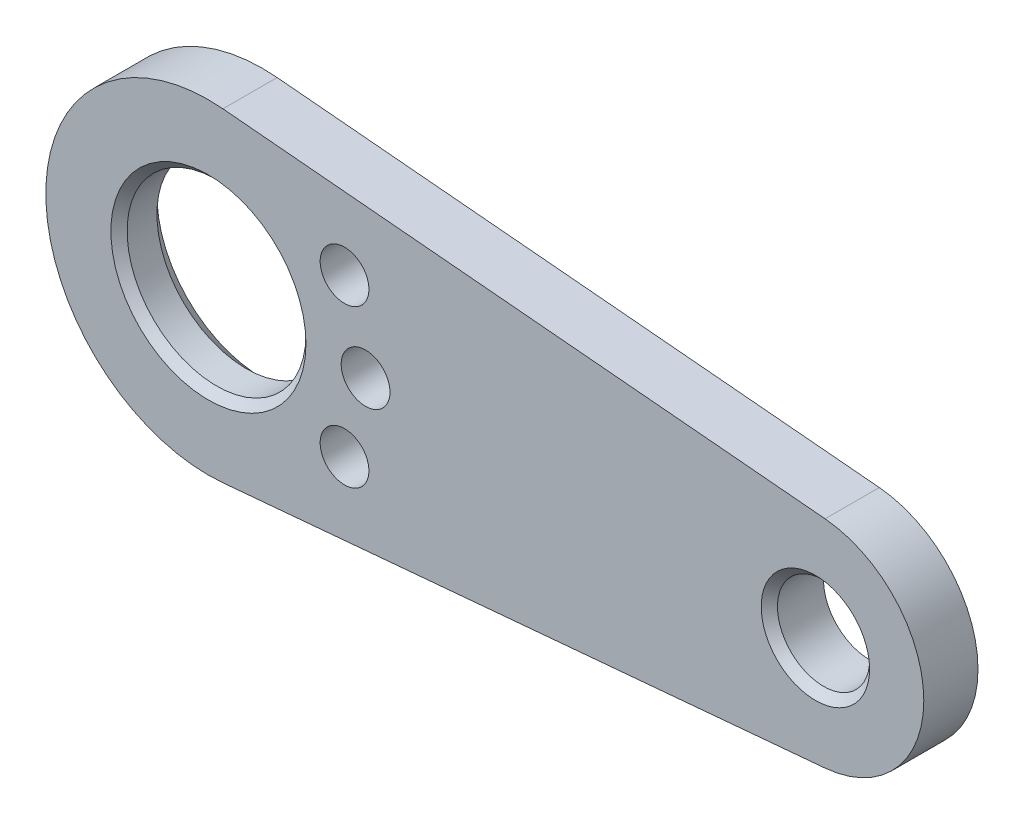
ISO-10303-21;
HEADER;
FILE_DESCRIPTION(('STEP AP214'),'2;1');
FILE_NAME('part.step','',(''),(''),'','','');
FILE_SCHEMA(('AUTOMOTIVE_DESIGN { 1 0 10303 214 1 1 1 1 }'));
ENDSEC;
DATA;
#1=APPLICATION_CONTEXT('core data for automotive mechanical design processes');
#2=APPLICATION_PROTOCOL_DEFINITION('international standard','automotive_design',2000,#1);
#3=PRODUCT_CONTEXT('',#1,'mechanical');
#4=PRODUCT('Part','Part','',(#3));
#5=PRODUCT_RELATED_PRODUCT_CATEGORY('part','',(#4));
#6=PRODUCT_DEFINITION_FORMATION('','',#4);
#7=PRODUCT_DEFINITION_CONTEXT('part definition',#1,'design');
#8=PRODUCT_DEFINITION('design','',#6,#7);
#9=PRODUCT_DEFINITION_SHAPE('','',#8);
#10=(LENGTH_UNIT() NAMED_UNIT(*) SI_UNIT(.MILLI.,.METRE.));
#11=(NAMED_UNIT(*) PLANE_ANGLE_UNIT() SI_UNIT($,.RADIAN.));
#12=(NAMED_UNIT(*) SI_UNIT($,.STERADIAN.) SOLID_ANGLE_UNIT());
#13=UNCERTAINTY_MEASURE_WITH_UNIT(LENGTH_MEASURE(1.E-05),#10,'distance_accuracy_value','');
#14=(GEOMETRIC_REPRESENTATION_CONTEXT(3) GLOBAL_UNCERTAINTY_ASSIGNED_CONTEXT((#13)) GLOBAL_UNIT_ASSIGNED_CONTEXT((#10,
#11,#12)) REPRESENTATION_CONTEXT('',''));
#15=CARTESIAN_POINT('',(0.,0.,0.));
#16=DIRECTION('',(0.,0.,1.));
#17=DIRECTION('',(1.,0.,0.));
#18=AXIS2_PLACEMENT_3D('',#15,#16,#17);
#19=CARTESIAN_POINT('',(0.,0.,-1.));
#20=DIRECTION('',(0.,0.,1.));
#21=DIRECTION('',(1.,0.,0.));
#22=AXIS2_PLACEMENT_3D('',#19,#20,#21);
#23=CYLINDRICAL_SURFACE('',#22,3.);
#24=CARTESIAN_POINT('',(0.,0.,0.));
#25=DIRECTION('',(0.,0.,1.));
#26=DIRECTION('',(1.,0.,0.));
#27=AXIS2_PLACEMENT_3D('',#24,#25,#26);
#28=CIRCLE('',#27,3.);
#29=CARTESIAN_POINT('',(0.267857142857143,2.9880181644395,0.));
#30=VERTEX_POINT('',#29);
#31=CARTESIAN_POINT('',(0.267857142857143,-2.9880181644395,0.));
#32=VERTEX_POINT('',#31);
#33=EDGE_CURVE('E138',#30,#32,#28,.T.);
#34=ORIENTED_EDGE('',*,*,#33,.F.);
#35=DIRECTION('',(0.,0.,1.));
#36=VECTOR('',#35,1.);
#37=CARTESIAN_POINT('',(0.267857142857143,2.9880181644395,-1.));
#38=LINE('',#37,#36);
#39=CARTESIAN_POINT('',(0.267857142857143,2.9880181644395,-1.));
#40=VERTEX_POINT('',#39);
#41=EDGE_CURVE('E86',#40,#30,#38,.T.);
#42=ORIENTED_EDGE('',*,*,#41,.F.);
#43=CARTESIAN_POINT('',(0.,0.,-1.));
#44=DIRECTION('',(0.,0.,1.));
#45=DIRECTION('',(1.,0.,0.));
#46=AXIS2_PLACEMENT_3D('',#43,#44,#45);
#47=CIRCLE('',#46,3.);
#48=CARTESIAN_POINT('',(0.267857142857143,-2.9880181644395,-1.));
#49=VERTEX_POINT('',#48);
#50=EDGE_CURVE('E131',#40,#49,#47,.T.);
#51=ORIENTED_EDGE('',*,*,#50,.T.);
#52=DIRECTION('',(0.,0.,1.));
#53=VECTOR('',#52,1.);
#54=CARTESIAN_POINT('',(0.267857142857143,-2.9880181644395,-1.));
#55=LINE('',#54,#53);
#56=EDGE_CURVE('E114',#49,#32,#55,.T.);
#57=ORIENTED_EDGE('',*,*,#56,.T.);
#58=EDGE_LOOP('',(#34,#42,#51,#57));
#59=FACE_BOUND('',#58,.T.);
#60=ADVANCED_FACE('F69',(#59),#23,.T.);
#61=CARTESIAN_POINT('',(0.267857142857143,2.9880181644395,-1.));
#62=DIRECTION('',(0.0892857142857142,0.996006054813167,0.));
#63=DIRECTION('',(-0.996006054813167,0.0892857142857142,0.));
#64=AXIS2_PLACEMENT_3D('',#61,#62,#63);
#65=PLANE('',#64);
#66=DIRECTION('',(-0.996006054813167,0.0892857142857142,0.));
#67=VECTOR('',#66,1.);
#68=CARTESIAN_POINT('',(0.267857142857143,2.9880181644395,0.));
#69=LINE('',#68,#67);
#70=CARTESIAN_POINT('',(11.3785714285714,1.99201210962634,0.));
#71=VERTEX_POINT('',#70);
#72=EDGE_CURVE('E133',#71,#30,#69,.T.);
#73=ORIENTED_EDGE('',*,*,#72,.F.);
#74=DIRECTION('',(0.,0.,1.));
#75=VECTOR('',#74,1.);
#76=CARTESIAN_POINT('',(11.3785714285714,1.99201210962634,-1.));
#77=LINE('',#76,#75);
#78=CARTESIAN_POINT('',(11.3785714285714,1.99201210962634,-1.));
#79=VERTEX_POINT('',#78);
#80=EDGE_CURVE('E103',#79,#71,#77,.T.);
#81=ORIENTED_EDGE('',*,*,#80,.F.);
#82=DIRECTION('',(-0.996006054813167,0.0892857142857142,0.));
#83=VECTOR('',#82,1.);
#84=CARTESIAN_POINT('',(0.267857142857143,2.9880181644395,-1.));
#85=LINE('',#84,#83);
#86=EDGE_CURVE('E128',#79,#40,#85,.T.);
#87=ORIENTED_EDGE('',*,*,#86,.T.);
#88=ORIENTED_EDGE('',*,*,#41,.T.);
#89=EDGE_LOOP('',(#73,#81,#87,#88));
#90=FACE_BOUND('',#89,.T.);
#91=ADVANCED_FACE('F181',(#90),#65,.T.);
#92=CARTESIAN_POINT('',(11.2,0.,-1.));
#93=DIRECTION('',(0.,0.,1.));
#94=DIRECTION('',(1.,0.,0.));
#95=AXIS2_PLACEMENT_3D('',#92,#93,#94);
#96=CYLINDRICAL_SURFACE('',#95,2.);
#97=CARTESIAN_POINT('',(11.2,0.,0.));
#98=DIRECTION('',(0.,0.,1.));
#99=DIRECTION('',(1.,0.,0.));
#100=AXIS2_PLACEMENT_3D('',#97,#98,#99);
#101=CIRCLE('',#100,2.);
#102=CARTESIAN_POINT('',(11.3785714285714,-1.99201210962634,0.));
#103=VERTEX_POINT('',#102);
#104=EDGE_CURVE('E122',#103,#71,#101,.T.);
#105=ORIENTED_EDGE('',*,*,#104,.F.);
#106=DIRECTION('',(0.,0.,1.));
#107=VECTOR('',#106,1.);
#108=CARTESIAN_POINT('',(11.3785714285714,-1.99201210962634,-1.));
#109=LINE('',#108,#107);
#110=CARTESIAN_POINT('',(11.3785714285714,-1.99201210962634,-1.));
#111=VERTEX_POINT('',#110);
#112=EDGE_CURVE('E117',#111,#103,#109,.T.);
#113=ORIENTED_EDGE('',*,*,#112,.F.);
#114=CARTESIAN_POINT('',(11.2,0.,-1.));
#115=DIRECTION('',(0.,0.,1.));
#116=DIRECTION('',(1.,0.,0.));
#117=AXIS2_PLACEMENT_3D('',#114,#115,#116);
#118=CIRCLE('',#117,2.);
#119=EDGE_CURVE('E120',#111,#79,#118,.T.);
#120=ORIENTED_EDGE('',*,*,#119,.T.);
#121=ORIENTED_EDGE('',*,*,#80,.T.);
#122=EDGE_LOOP('',(#105,#113,#120,#121));
#123=FACE_BOUND('',#122,.T.);
#124=ADVANCED_FACE('F119',(#123),#96,.T.);
#125=CARTESIAN_POINT('',(0.267857142857143,-2.9880181644395,-1.));
#126=DIRECTION('',(0.0892857142857142,-0.996006054813167,0.));
#127=DIRECTION('',(0.996006054813167,0.0892857142857142,0.));
#128=AXIS2_PLACEMENT_3D('',#125,#126,#127);
#129=PLANE('',#128);
#130=DIRECTION('',(0.996006054813167,0.0892857142857142,0.));
#131=VECTOR('',#130,1.);
#132=CARTESIAN_POINT('',(0.267857142857143,-2.9880181644395,0.));
#133=LINE('',#132,#131);
#134=EDGE_CURVE('E141',#32,#103,#133,.T.);
#135=ORIENTED_EDGE('',*,*,#134,.F.);
#136=ORIENTED_EDGE('',*,*,#56,.F.);
#137=DIRECTION('',(0.996006054813167,0.0892857142857142,0.));
#138=VECTOR('',#137,1.);
#139=CARTESIAN_POINT('',(0.267857142857143,-2.9880181644395,-1.));
#140=LINE('',#139,#138);
#141=EDGE_CURVE('E127',#49,#111,#140,.T.);
#142=ORIENTED_EDGE('',*,*,#141,.T.);
#143=ORIENTED_EDGE('',*,*,#112,.T.);
#144=EDGE_LOOP('',(#135,#136,#142,#143));
#145=FACE_BOUND('',#144,.T.);
#146=ADVANCED_FACE('F130',(#145),#129,.T.);
#147=CARTESIAN_POINT('',(0.,0.,-1.));
#148=DIRECTION('',(0.,0.,1.));
#149=DIRECTION('',(1.,0.,0.));
#150=AXIS2_PLACEMENT_3D('',#147,#148,#149);
#151=PLANE('',#150);
#152=CARTESIAN_POINT('',(2.9,0.,-1.));
#153=DIRECTION('',(0.,0.,1.));
#154=DIRECTION('',(1.,0.,0.));
#155=AXIS2_PLACEMENT_3D('',#152,#153,#154);
#156=CIRCLE('',#155,0.45);
#157=CARTESIAN_POINT('',(3.35,0.,-1.));
#158=VERTEX_POINT('',#157);
#159=EDGE_CURVE('E218',#158,#158,#156,.T.);
#160=ORIENTED_EDGE('',*,*,#159,.T.);
#161=EDGE_LOOP('',(#160));
#162=FACE_BOUND('',#161,.T.);
#163=CARTESIAN_POINT('',(2.51147367097487,1.45,-1.));
#164=DIRECTION('',(0.,0.,1.));
#165=DIRECTION('',(1.,0.,0.));
#166=AXIS2_PLACEMENT_3D('',#163,#164,#165);
#167=CIRCLE('',#166,0.45);
#168=CARTESIAN_POINT('',(2.96147367097487,1.45,-1.));
#169=VERTEX_POINT('',#168);
#170=EDGE_CURVE('E212',#169,#169,#167,.T.);
#171=ORIENTED_EDGE('',*,*,#170,.T.);
#172=EDGE_LOOP('',(#171));
#173=FACE_BOUND('',#172,.T.);
#174=CARTESIAN_POINT('',(2.51147367097487,-1.45,-1.));
#175=DIRECTION('',(0.,0.,1.));
#176=DIRECTION('',(1.,0.,0.));
#177=AXIS2_PLACEMENT_3D('',#174,#175,#176);
#178=CIRCLE('',#177,0.45);
#179=CARTESIAN_POINT('',(2.96147367097487,-1.45,-1.));
#180=VERTEX_POINT('',#179);
#181=EDGE_CURVE('E205',#180,#180,#178,.T.);
#182=ORIENTED_EDGE('',*,*,#181,.T.);
#183=EDGE_LOOP('',(#182));
#184=FACE_BOUND('',#183,.T.);
#185=CARTESIAN_POINT('',(0.,0.,-1.));
#186=DIRECTION('',(0.,0.,1.));
#187=DIRECTION('',(1.,0.,0.));
#188=AXIS2_PLACEMENT_3D('',#185,#186,#187);
#189=CIRCLE('',#188,1.95);
#190=CARTESIAN_POINT('',(1.95,0.,-1.));
#191=VERTEX_POINT('',#190);
#192=EDGE_CURVE('E78',#191,#191,#189,.T.);
#193=ORIENTED_EDGE('',*,*,#192,.T.);
#194=EDGE_LOOP('',(#193));
#195=FACE_BOUND('',#194,.T.);
#196=CARTESIAN_POINT('',(11.2,0.,-1.));
#197=DIRECTION('',(0.,0.,1.));
#198=DIRECTION('',(1.,0.,0.));
#199=AXIS2_PLACEMENT_3D('',#196,#197,#198);
#200=CIRCLE('',#199,0.85);
#201=CARTESIAN_POINT('',(12.05,0.,-1.));
#202=VERTEX_POINT('',#201);
#203=EDGE_CURVE('E142',#202,#202,#200,.T.);
#204=ORIENTED_EDGE('',*,*,#203,.T.);
#205=EDGE_LOOP('',(#204));
#206=FACE_BOUND('',#205,.T.);
#207=ORIENTED_EDGE('',*,*,#50,.F.);
#208=ORIENTED_EDGE('',*,*,#86,.F.);
#209=ORIENTED_EDGE('',*,*,#119,.F.);
#210=ORIENTED_EDGE('',*,*,#141,.F.);
#211=EDGE_LOOP('',(#207,#208,#209,#210));
#212=FACE_BOUND('',#211,.T.);
#213=ADVANCED_FACE('F126',(#162,#173,#184,#195,#206,#212),#151,.F.);
#214=CARTESIAN_POINT('',(0.,0.,0.));
#215=DIRECTION('',(0.,0.,1.));
#216=DIRECTION('',(1.,0.,0.));
#217=AXIS2_PLACEMENT_3D('',#214,#215,#216);
#218=PLANE('',#217);
#219=CARTESIAN_POINT('',(2.9,0.,0.));
#220=DIRECTION('',(0.,0.,1.));
#221=DIRECTION('',(1.,0.,0.));
#222=AXIS2_PLACEMENT_3D('',#219,#220,#221);
#223=CIRCLE('',#222,0.45);
#224=CARTESIAN_POINT('',(3.35,0.,0.));
#225=VERTEX_POINT('',#224);
#226=EDGE_CURVE('E221',#225,#225,#223,.T.);
#227=ORIENTED_EDGE('',*,*,#226,.F.);
#228=EDGE_LOOP('',(#227));
#229=FACE_BOUND('',#228,.T.);
#230=CARTESIAN_POINT('',(2.51147367097487,1.45,0.));
#231=DIRECTION('',(0.,0.,1.));
#232=DIRECTION('',(1.,0.,0.));
#233=AXIS2_PLACEMENT_3D('',#230,#231,#232);
#234=CIRCLE('',#233,0.45);
#235=CARTESIAN_POINT('',(2.96147367097487,1.45,0.));
#236=VERTEX_POINT('',#235);
#237=EDGE_CURVE('E215',#236,#236,#234,.T.);
#238=ORIENTED_EDGE('',*,*,#237,.F.);
#239=EDGE_LOOP('',(#238));
#240=FACE_BOUND('',#239,.T.);
#241=CARTESIAN_POINT('',(2.51147367097487,-1.45,0.));
#242=DIRECTION('',(0.,0.,1.));
#243=DIRECTION('',(1.,0.,0.));
#244=AXIS2_PLACEMENT_3D('',#241,#242,#243);
#245=CIRCLE('',#244,0.45);
#246=CARTESIAN_POINT('',(2.96147367097487,-1.45,0.));
#247=VERTEX_POINT('',#246);
#248=EDGE_CURVE('E207',#247,#247,#245,.T.);
#249=ORIENTED_EDGE('',*,*,#248,.F.);
#250=EDGE_LOOP('',(#249));
#251=FACE_BOUND('',#250,.T.);
#252=CARTESIAN_POINT('',(11.2,0.,0.));
#253=DIRECTION('',(0.,0.,1.));
#254=DIRECTION('',(1.,0.,0.));
#255=AXIS2_PLACEMENT_3D('',#252,#253,#254);
#256=CIRCLE('',#255,1.);
#257=CARTESIAN_POINT('',(12.2,0.,0.));
#258=VERTEX_POINT('',#257);
#259=EDGE_CURVE('E156',#258,#258,#256,.F.);
#260=ORIENTED_EDGE('',*,*,#259,.T.);
#261=EDGE_LOOP('',(#260));
#262=FACE_BOUND('',#261,.T.);
#263=CARTESIAN_POINT('',(0.,0.,0.));
#264=DIRECTION('',(0.,0.,1.));
#265=DIRECTION('',(1.,0.,0.));
#266=AXIS2_PLACEMENT_3D('',#263,#264,#265);
#267=CIRCLE('',#266,1.8);
#268=CARTESIAN_POINT('',(1.8,0.,0.));
#269=VERTEX_POINT('',#268);
#270=EDGE_CURVE('E153',#269,#269,#267,.F.);
#271=ORIENTED_EDGE('',*,*,#270,.T.);
#272=EDGE_LOOP('',(#271));
#273=FACE_BOUND('',#272,.T.);
#274=ORIENTED_EDGE('',*,*,#33,.T.);
#275=ORIENTED_EDGE('',*,*,#134,.T.);
#276=ORIENTED_EDGE('',*,*,#104,.T.);
#277=ORIENTED_EDGE('',*,*,#72,.T.);
#278=EDGE_LOOP('',(#274,#275,#276,#277));
#279=FACE_BOUND('',#278,.T.);
#280=ADVANCED_FACE('F227',(#229,#240,#251,#262,#273,#279),#218,.T.);
#281=CARTESIAN_POINT('',(0.,0.,-1.));
#282=DIRECTION('',(0.,0.,1.));
#283=DIRECTION('',(1.,0.,0.));
#284=AXIS2_PLACEMENT_3D('',#281,#282,#283);
#285=CYLINDRICAL_SURFACE('',#284,1.65);
#286=CARTESIAN_POINT('',(0.,0.,-0.700000000000003));
#287=DIRECTION('',(0.,0.,1.));
#288=DIRECTION('',(1.,0.,0.));
#289=AXIS2_PLACEMENT_3D('',#286,#287,#288);
#290=CIRCLE('',#289,1.65);
#291=CARTESIAN_POINT('',(1.65,0.,-0.700000000000003));
#292=VERTEX_POINT('',#291);
#293=EDGE_CURVE('E14',#292,#292,#290,.F.);
#294=ORIENTED_EDGE('',*,*,#293,.T.);
#295=EDGE_LOOP('',(#294));
#296=FACE_BOUND('',#295,.T.);
#297=CARTESIAN_POINT('',(0.,0.,-0.150000000000001));
#298=DIRECTION('',(0.,0.,1.));
#299=DIRECTION('',(1.,0.,0.));
#300=AXIS2_PLACEMENT_3D('',#297,#298,#299);
#301=CIRCLE('',#300,1.65);
#302=CARTESIAN_POINT('',(1.65,0.,-0.150000000000001));
#303=VERTEX_POINT('',#302);
#304=EDGE_CURVE('E159',#303,#303,#301,.T.);
#305=ORIENTED_EDGE('',*,*,#304,.T.);
#306=EDGE_LOOP('',(#305));
#307=FACE_BOUND('',#306,.T.);
#308=ADVANCED_FACE('F196',(#296,#307),#285,.F.);
#309=CARTESIAN_POINT('',(11.2,0.,-1.));
#310=DIRECTION('',(0.,0.,1.));
#311=DIRECTION('',(1.,0.,0.));
#312=AXIS2_PLACEMENT_3D('',#309,#310,#311);
#313=CYLINDRICAL_SURFACE('',#312,0.85);
#314=CARTESIAN_POINT('',(11.2,0.,-0.150000000000001));
#315=DIRECTION('',(0.,0.,1.));
#316=DIRECTION('',(1.,0.,0.));
#317=AXIS2_PLACEMENT_3D('',#314,#315,#316);
#318=CIRCLE('',#317,0.85);
#319=CARTESIAN_POINT('',(12.05,0.,-0.150000000000001));
#320=VERTEX_POINT('',#319);
#321=EDGE_CURVE('E148',#320,#320,#318,.T.);
#322=ORIENTED_EDGE('',*,*,#321,.T.);
#323=EDGE_LOOP('',(#322));
#324=FACE_BOUND('',#323,.T.);
#325=ORIENTED_EDGE('',*,*,#203,.F.);
#326=EDGE_LOOP('',(#325));
#327=FACE_BOUND('',#326,.T.);
#328=ADVANCED_FACE('F191',(#324,#327),#313,.F.);
#329=CARTESIAN_POINT('',(11.2,0.,-0.150000000000001));
#330=DIRECTION('',(0.,0.,1.));
#331=DIRECTION('',(1.,0.,0.));
#332=AXIS2_PLACEMENT_3D('',#329,#330,#331);
#333=CONICAL_SURFACE('',#332,0.85,0.78539816339745);
#334=ORIENTED_EDGE('',*,*,#259,.F.);
#335=EDGE_LOOP('',(#334));
#336=FACE_BOUND('',#335,.T.);
#337=ORIENTED_EDGE('',*,*,#321,.F.);
#338=EDGE_LOOP('',(#337));
#339=FACE_BOUND('',#338,.T.);
#340=ADVANCED_FACE('F177',(#336,#339),#333,.F.);
#341=CARTESIAN_POINT('',(0.,0.,-0.150000000000001));
#342=DIRECTION('',(0.,0.,1.));
#343=DIRECTION('',(1.,0.,0.));
#344=AXIS2_PLACEMENT_3D('',#341,#342,#343);
#345=CONICAL_SURFACE('',#344,1.65,0.785398163397453);
#346=ORIENTED_EDGE('',*,*,#270,.F.);
#347=EDGE_LOOP('',(#346));
#348=FACE_BOUND('',#347,.T.);
#349=ORIENTED_EDGE('',*,*,#304,.F.);
#350=EDGE_LOOP('',(#349));
#351=FACE_BOUND('',#350,.T.);
#352=ADVANCED_FACE('F168',(#348,#351),#345,.F.);
#353=CARTESIAN_POINT('',(0.,0.,-1.));
#354=DIRECTION('',(0.,0.,-1.));
#355=DIRECTION('',(-1.,0.,0.));
#356=AXIS2_PLACEMENT_3D('',#353,#354,#355);
#357=CONICAL_SURFACE('',#356,1.95,0.785398163397444);
#358=ORIENTED_EDGE('',*,*,#293,.F.);
#359=EDGE_LOOP('',(#358));
#360=FACE_BOUND('',#359,.T.);
#361=ORIENTED_EDGE('',*,*,#192,.F.);
#362=EDGE_LOOP('',(#361));
#363=FACE_BOUND('',#362,.T.);
#364=ADVANCED_FACE('F71',(#360,#363),#357,.F.);
#365=CARTESIAN_POINT('',(2.51147367097487,-1.45,0.));
#366=DIRECTION('',(0.,0.,1.));
#367=DIRECTION('',(1.,0.,0.));
#368=AXIS2_PLACEMENT_3D('',#365,#366,#367);
#369=CYLINDRICAL_SURFACE('',#368,0.45);
#370=ORIENTED_EDGE('',*,*,#181,.F.);
#371=EDGE_LOOP('',(#370));
#372=FACE_BOUND('',#371,.T.);
#373=ORIENTED_EDGE('',*,*,#248,.T.);
#374=EDGE_LOOP('',(#373));
#375=FACE_BOUND('',#374,.T.);
#376=ADVANCED_FACE('F167',(#372,#375),#369,.F.);
#377=CARTESIAN_POINT('',(2.51147367097487,1.45,0.));
#378=DIRECTION('',(0.,0.,1.));
#379=DIRECTION('',(1.,0.,0.));
#380=AXIS2_PLACEMENT_3D('',#377,#378,#379);
#381=CYLINDRICAL_SURFACE('',#380,0.45);
#382=ORIENTED_EDGE('',*,*,#170,.F.);
#383=EDGE_LOOP('',(#382));
#384=FACE_BOUND('',#383,.T.);
#385=ORIENTED_EDGE('',*,*,#237,.T.);
#386=EDGE_LOOP('',(#385));
#387=FACE_BOUND('',#386,.T.);
#388=ADVANCED_FACE('F174',(#384,#387),#381,.F.);
#389=CARTESIAN_POINT('',(2.9,0.,0.));
#390=DIRECTION('',(0.,0.,1.));
#391=DIRECTION('',(1.,0.,0.));
#392=AXIS2_PLACEMENT_3D('',#389,#390,#391);
#393=CYLINDRICAL_SURFACE('',#392,0.45);
#394=ORIENTED_EDGE('',*,*,#159,.F.);
#395=EDGE_LOOP('',(#394));
#396=FACE_BOUND('',#395,.T.);
#397=ORIENTED_EDGE('',*,*,#226,.T.);
#398=EDGE_LOOP('',(#397));
#399=FACE_BOUND('',#398,.T.);
#400=ADVANCED_FACE('F225',(#396,#399),#393,.F.);
#401=CLOSED_SHELL('',(#60,#91,#124,#146,#213,#280,#308,#328,#340,#352,#364,#376,#388,#400));
#402=MANIFOLD_SOLID_BREP('B2',#401);
#403=ADVANCED_BREP_SHAPE_REPRESENTATION('',(#18,#402),#14);
#404=SHAPE_DEFINITION_REPRESENTATION(#9,#403);
ENDSEC;
END-ISO-10303-21;
